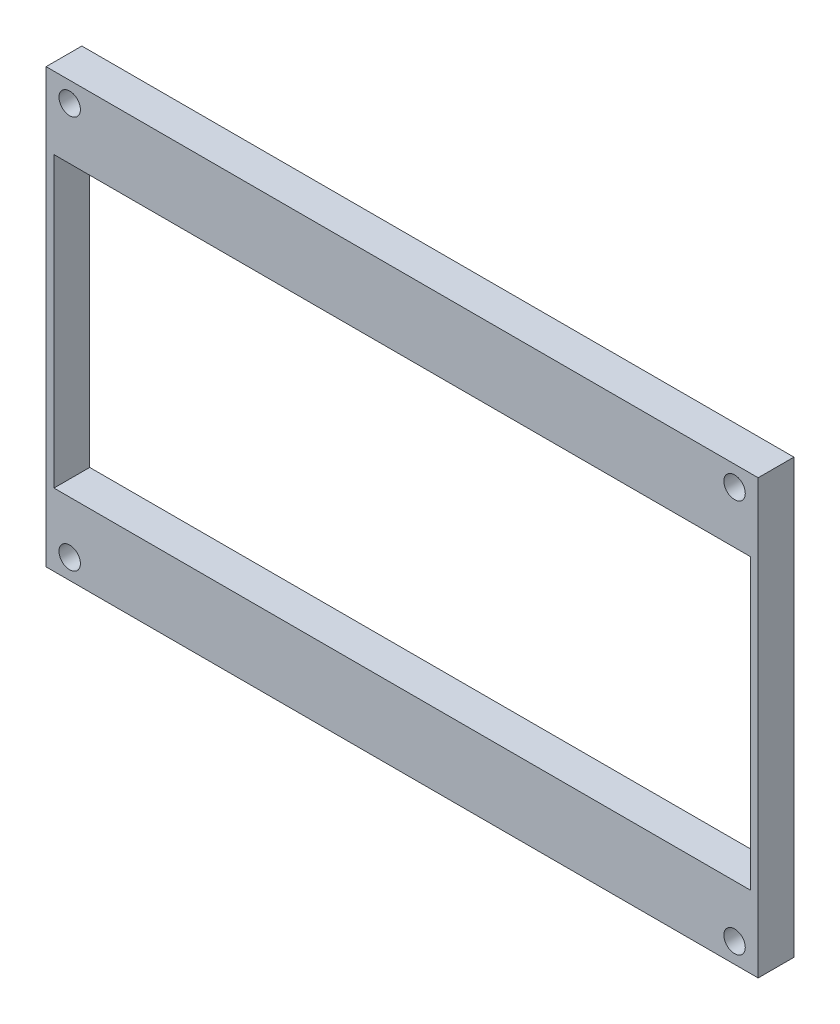
ISO-10303-21;
HEADER;
FILE_DESCRIPTION(('STEP AP214'),'2;1');
FILE_NAME('part.step','',(''),(''),'','','');
FILE_SCHEMA(('AUTOMOTIVE_DESIGN { 1 0 10303 214 1 1 1 1 }'));
ENDSEC;
DATA;
#1=APPLICATION_CONTEXT('core data for automotive mechanical design processes');
#2=APPLICATION_PROTOCOL_DEFINITION('international standard','automotive_design',2000,#1);
#3=PRODUCT_CONTEXT('',#1,'mechanical');
#4=PRODUCT('Part','Part','',(#3));
#5=PRODUCT_RELATED_PRODUCT_CATEGORY('part','',(#4));
#6=PRODUCT_DEFINITION_FORMATION('','',#4);
#7=PRODUCT_DEFINITION_CONTEXT('part definition',#1,'design');
#8=PRODUCT_DEFINITION('design','',#6,#7);
#9=PRODUCT_DEFINITION_SHAPE('','',#8);
#10=(LENGTH_UNIT() NAMED_UNIT(*) SI_UNIT(.MILLI.,.METRE.));
#11=(NAMED_UNIT(*) PLANE_ANGLE_UNIT() SI_UNIT($,.RADIAN.));
#12=(NAMED_UNIT(*) SI_UNIT($,.STERADIAN.) SOLID_ANGLE_UNIT());
#13=UNCERTAINTY_MEASURE_WITH_UNIT(LENGTH_MEASURE(1.E-05),#10,'distance_accuracy_value','');
#14=(GEOMETRIC_REPRESENTATION_CONTEXT(3) GLOBAL_UNCERTAINTY_ASSIGNED_CONTEXT((#13)) GLOBAL_UNIT_ASSIGNED_CONTEXT((#10,
#11,#12)) REPRESENTATION_CONTEXT('',''));
#15=CARTESIAN_POINT('',(0.,0.,0.));
#16=DIRECTION('',(0.,0.,1.));
#17=DIRECTION('',(1.,0.,0.));
#18=AXIS2_PLACEMENT_3D('',#15,#16,#17);
#19=CARTESIAN_POINT('',(0.,0.,5.));
#20=DIRECTION('',(0.,0.,1.));
#21=DIRECTION('',(1.,0.,0.));
#22=AXIS2_PLACEMENT_3D('',#19,#20,#21);
#23=PLANE('',#22);
#24=CARTESIAN_POINT('',(69.5,52.,5.));
#25=DIRECTION('',(0.,0.,1.));
#26=DIRECTION('',(1.,0.,0.));
#27=AXIS2_PLACEMENT_3D('',#24,#25,#26);
#28=CIRCLE('',#27,1.5);
#29=CARTESIAN_POINT('',(71.,52.,5.));
#30=VERTEX_POINT('',#29);
#31=EDGE_CURVE('E247',#30,#30,#28,.T.);
#32=ORIENTED_EDGE('',*,*,#31,.F.);
#33=EDGE_LOOP('',(#32));
#34=FACE_BOUND('',#33,.T.);
#35=CARTESIAN_POINT('',(-23.5,-3.00000000000001,5.));
#36=DIRECTION('',(0.,0.,1.));
#37=DIRECTION('',(1.,0.,0.));
#38=AXIS2_PLACEMENT_3D('',#35,#36,#37);
#39=CIRCLE('',#38,1.5);
#40=CARTESIAN_POINT('',(-22.,-3.00000000000001,5.));
#41=VERTEX_POINT('',#40);
#42=EDGE_CURVE('E129',#41,#41,#39,.T.);
#43=ORIENTED_EDGE('',*,*,#42,.F.);
#44=EDGE_LOOP('',(#43));
#45=FACE_BOUND('',#44,.T.);
#46=DIRECTION('',(0.,-1.,0.));
#47=VECTOR('',#46,1.);
#48=CARTESIAN_POINT('',(-26.8,54.8,5.));
#49=LINE('',#48,#47);
#50=CARTESIAN_POINT('',(-26.8,54.8,5.));
#51=VERTEX_POINT('',#50);
#52=CARTESIAN_POINT('',(-26.8,-5.80000000000001,5.));
#53=VERTEX_POINT('',#52);
#54=EDGE_CURVE('E139',#51,#53,#49,.T.);
#55=ORIENTED_EDGE('',*,*,#54,.T.);
#56=DIRECTION('',(1.,0.,0.));
#57=VECTOR('',#56,1.);
#58=CARTESIAN_POINT('',(-26.8,-5.80000000000001,5.));
#59=LINE('',#58,#57);
#60=CARTESIAN_POINT('',(72.8,-5.80000000000001,5.));
#61=VERTEX_POINT('',#60);
#62=EDGE_CURVE('E142',#53,#61,#59,.T.);
#63=ORIENTED_EDGE('',*,*,#62,.T.);
#64=DIRECTION('',(0.,1.,0.));
#65=VECTOR('',#64,1.);
#66=CARTESIAN_POINT('',(72.8,-5.80000000000001,5.));
#67=LINE('',#66,#65);
#68=CARTESIAN_POINT('',(72.8,54.8,5.));
#69=VERTEX_POINT('',#68);
#70=EDGE_CURVE('E145',#61,#69,#67,.T.);
#71=ORIENTED_EDGE('',*,*,#70,.T.);
#72=DIRECTION('',(-1.,0.,0.));
#73=VECTOR('',#72,1.);
#74=CARTESIAN_POINT('',(72.8,54.8,5.));
#75=LINE('',#74,#73);
#76=EDGE_CURVE('E147',#69,#51,#75,.T.);
#77=ORIENTED_EDGE('',*,*,#76,.T.);
#78=EDGE_LOOP('',(#55,#63,#71,#77));
#79=FACE_BOUND('',#78,.T.);
#80=DIRECTION('',(1.,0.,0.));
#81=VECTOR('',#80,1.);
#82=CARTESIAN_POINT('',(-25.7,4.29999999999999,5.));
#83=LINE('',#82,#81);
#84=CARTESIAN_POINT('',(-25.7,4.29999999999999,5.));
#85=VERTEX_POINT('',#84);
#86=CARTESIAN_POINT('',(71.7,4.3,5.));
#87=VERTEX_POINT('',#86);
#88=EDGE_CURVE('E108',#85,#87,#83,.T.);
#89=ORIENTED_EDGE('',*,*,#88,.F.);
#90=DIRECTION('',(0.,-1.,0.));
#91=VECTOR('',#90,1.);
#92=CARTESIAN_POINT('',(-25.7,44.7,5.));
#93=LINE('',#92,#91);
#94=CARTESIAN_POINT('',(-25.7,44.7,5.));
#95=VERTEX_POINT('',#94);
#96=EDGE_CURVE('E100',#95,#85,#93,.T.);
#97=ORIENTED_EDGE('',*,*,#96,.F.);
#98=DIRECTION('',(-1.,0.,0.));
#99=VECTOR('',#98,1.);
#100=CARTESIAN_POINT('',(71.7,44.7,5.));
#101=LINE('',#100,#99);
#102=CARTESIAN_POINT('',(71.7,44.7,5.));
#103=VERTEX_POINT('',#102);
#104=EDGE_CURVE('E123',#103,#95,#101,.T.);
#105=ORIENTED_EDGE('',*,*,#104,.F.);
#106=DIRECTION('',(0.,1.,0.));
#107=VECTOR('',#106,1.);
#108=CARTESIAN_POINT('',(71.7,4.3,5.));
#109=LINE('',#108,#107);
#110=EDGE_CURVE('E121',#87,#103,#109,.T.);
#111=ORIENTED_EDGE('',*,*,#110,.F.);
#112=EDGE_LOOP('',(#89,#97,#105,#111));
#113=FACE_BOUND('',#112,.T.);
#114=CARTESIAN_POINT('',(69.5,-3.00000000000001,5.));
#115=DIRECTION('',(0.,0.,1.));
#116=DIRECTION('',(1.,0.,0.));
#117=AXIS2_PLACEMENT_3D('',#114,#115,#116);
#118=CIRCLE('',#117,1.5);
#119=CARTESIAN_POINT('',(71.,-3.00000000000001,5.));
#120=VERTEX_POINT('',#119);
#121=EDGE_CURVE('E253',#120,#120,#118,.T.);
#122=ORIENTED_EDGE('',*,*,#121,.F.);
#123=EDGE_LOOP('',(#122));
#124=FACE_BOUND('',#123,.T.);
#125=CARTESIAN_POINT('',(-23.5,52.,5.));
#126=DIRECTION('',(0.,0.,1.));
#127=DIRECTION('',(1.,0.,0.));
#128=AXIS2_PLACEMENT_3D('',#125,#126,#127);
#129=CIRCLE('',#128,1.5);
#130=CARTESIAN_POINT('',(-22.,52.,5.));
#131=VERTEX_POINT('',#130);
#132=EDGE_CURVE('E238',#131,#131,#129,.T.);
#133=ORIENTED_EDGE('',*,*,#132,.F.);
#134=EDGE_LOOP('',(#133));
#135=FACE_BOUND('',#134,.T.);
#136=ADVANCED_FACE('F35',(#34,#45,#79,#113,#124,#135),#23,.T.);
#137=CARTESIAN_POINT('',(0.,0.,0.));
#138=DIRECTION('',(0.,0.,1.));
#139=DIRECTION('',(1.,0.,0.));
#140=AXIS2_PLACEMENT_3D('',#137,#138,#139);
#141=PLANE('',#140);
#142=DIRECTION('',(0.,-1.,0.));
#143=VECTOR('',#142,1.);
#144=CARTESIAN_POINT('',(-26.8,54.8,0.));
#145=LINE('',#144,#143);
#146=CARTESIAN_POINT('',(-26.8,54.8,0.));
#147=VERTEX_POINT('',#146);
#148=CARTESIAN_POINT('',(-26.8,-5.80000000000001,0.));
#149=VERTEX_POINT('',#148);
#150=EDGE_CURVE('E116',#147,#149,#145,.T.);
#151=ORIENTED_EDGE('',*,*,#150,.F.);
#152=DIRECTION('',(-1.,0.,0.));
#153=VECTOR('',#152,1.);
#154=CARTESIAN_POINT('',(72.8,54.8,0.));
#155=LINE('',#154,#153);
#156=CARTESIAN_POINT('',(72.8,54.8,0.));
#157=VERTEX_POINT('',#156);
#158=EDGE_CURVE('E143',#157,#147,#155,.T.);
#159=ORIENTED_EDGE('',*,*,#158,.F.);
#160=DIRECTION('',(0.,1.,0.));
#161=VECTOR('',#160,1.);
#162=CARTESIAN_POINT('',(72.8,-5.80000000000001,0.));
#163=LINE('',#162,#161);
#164=CARTESIAN_POINT('',(72.8,-5.80000000000001,0.));
#165=VERTEX_POINT('',#164);
#166=EDGE_CURVE('E154',#165,#157,#163,.T.);
#167=ORIENTED_EDGE('',*,*,#166,.F.);
#168=DIRECTION('',(1.,0.,0.));
#169=VECTOR('',#168,1.);
#170=CARTESIAN_POINT('',(-26.8,-5.80000000000001,0.));
#171=LINE('',#170,#169);
#172=EDGE_CURVE('E152',#149,#165,#171,.T.);
#173=ORIENTED_EDGE('',*,*,#172,.F.);
#174=EDGE_LOOP('',(#151,#159,#167,#173));
#175=FACE_BOUND('',#174,.T.);
#176=DIRECTION('',(0.,-1.,0.));
#177=VECTOR('',#176,1.);
#178=CARTESIAN_POINT('',(-25.7,44.7,0.));
#179=LINE('',#178,#177);
#180=CARTESIAN_POINT('',(-25.7,44.7,0.));
#181=VERTEX_POINT('',#180);
#182=CARTESIAN_POINT('',(-25.7,4.29999999999999,0.));
#183=VERTEX_POINT('',#182);
#184=EDGE_CURVE('E58',#181,#183,#179,.T.);
#185=ORIENTED_EDGE('',*,*,#184,.T.);
#186=DIRECTION('',(1.,0.,0.));
#187=VECTOR('',#186,1.);
#188=CARTESIAN_POINT('',(-25.7,4.29999999999999,0.));
#189=LINE('',#188,#187);
#190=CARTESIAN_POINT('',(71.7,4.3,0.));
#191=VERTEX_POINT('',#190);
#192=EDGE_CURVE('E115',#183,#191,#189,.T.);
#193=ORIENTED_EDGE('',*,*,#192,.T.);
#194=DIRECTION('',(0.,1.,0.));
#195=VECTOR('',#194,1.);
#196=CARTESIAN_POINT('',(71.7,4.3,0.));
#197=LINE('',#196,#195);
#198=CARTESIAN_POINT('',(71.7,44.7,0.));
#199=VERTEX_POINT('',#198);
#200=EDGE_CURVE('E131',#191,#199,#197,.T.);
#201=ORIENTED_EDGE('',*,*,#200,.T.);
#202=DIRECTION('',(-1.,0.,0.));
#203=VECTOR('',#202,1.);
#204=CARTESIAN_POINT('',(71.7,44.7,0.));
#205=LINE('',#204,#203);
#206=EDGE_CURVE('E109',#199,#181,#205,.T.);
#207=ORIENTED_EDGE('',*,*,#206,.T.);
#208=EDGE_LOOP('',(#185,#193,#201,#207));
#209=FACE_BOUND('',#208,.T.);
#210=CARTESIAN_POINT('',(-23.5,-3.00000000000001,0.));
#211=DIRECTION('',(0.,0.,1.));
#212=DIRECTION('',(1.,0.,0.));
#213=AXIS2_PLACEMENT_3D('',#210,#211,#212);
#214=CIRCLE('',#213,1.5);
#215=CARTESIAN_POINT('',(-22.,-3.00000000000001,0.));
#216=VERTEX_POINT('',#215);
#217=EDGE_CURVE('E256',#216,#216,#214,.T.);
#218=ORIENTED_EDGE('',*,*,#217,.T.);
#219=EDGE_LOOP('',(#218));
#220=FACE_BOUND('',#219,.T.);
#221=CARTESIAN_POINT('',(69.5,-3.00000000000001,0.));
#222=DIRECTION('',(0.,0.,1.));
#223=DIRECTION('',(1.,0.,0.));
#224=AXIS2_PLACEMENT_3D('',#221,#222,#223);
#225=CIRCLE('',#224,1.5);
#226=CARTESIAN_POINT('',(71.,-3.00000000000001,0.));
#227=VERTEX_POINT('',#226);
#228=EDGE_CURVE('E250',#227,#227,#225,.T.);
#229=ORIENTED_EDGE('',*,*,#228,.T.);
#230=EDGE_LOOP('',(#229));
#231=FACE_BOUND('',#230,.T.);
#232=CARTESIAN_POINT('',(69.5,52.,0.));
#233=DIRECTION('',(0.,0.,1.));
#234=DIRECTION('',(1.,0.,0.));
#235=AXIS2_PLACEMENT_3D('',#232,#233,#234);
#236=CIRCLE('',#235,1.5);
#237=CARTESIAN_POINT('',(71.,52.,0.));
#238=VERTEX_POINT('',#237);
#239=EDGE_CURVE('E244',#238,#238,#236,.T.);
#240=ORIENTED_EDGE('',*,*,#239,.T.);
#241=EDGE_LOOP('',(#240));
#242=FACE_BOUND('',#241,.T.);
#243=CARTESIAN_POINT('',(-23.5,52.,0.));
#244=DIRECTION('',(0.,0.,1.));
#245=DIRECTION('',(1.,0.,0.));
#246=AXIS2_PLACEMENT_3D('',#243,#244,#245);
#247=CIRCLE('',#246,1.5);
#248=CARTESIAN_POINT('',(-22.,52.,0.));
#249=VERTEX_POINT('',#248);
#250=EDGE_CURVE('E241',#249,#249,#247,.T.);
#251=ORIENTED_EDGE('',*,*,#250,.T.);
#252=EDGE_LOOP('',(#251));
#253=FACE_BOUND('',#252,.T.);
#254=ADVANCED_FACE('F172',(#175,#209,#220,#231,#242,#253),#141,.F.);
#255=CARTESIAN_POINT('',(-26.8,54.8,5.));
#256=DIRECTION('',(1.,0.,0.));
#257=DIRECTION('',(0.,1.,0.));
#258=AXIS2_PLACEMENT_3D('',#255,#256,#257);
#259=PLANE('',#258);
#260=ORIENTED_EDGE('',*,*,#150,.T.);
#261=DIRECTION('',(0.,0.,-1.));
#262=VECTOR('',#261,1.);
#263=CARTESIAN_POINT('',(-26.8,-5.80000000000001,5.));
#264=LINE('',#263,#262);
#265=EDGE_CURVE('E11',#53,#149,#264,.T.);
#266=ORIENTED_EDGE('',*,*,#265,.F.);
#267=ORIENTED_EDGE('',*,*,#54,.F.);
#268=DIRECTION('',(0.,0.,-1.));
#269=VECTOR('',#268,1.);
#270=CARTESIAN_POINT('',(-26.8,54.8,5.));
#271=LINE('',#270,#269);
#272=EDGE_CURVE('E149',#51,#147,#271,.T.);
#273=ORIENTED_EDGE('',*,*,#272,.T.);
#274=EDGE_LOOP('',(#260,#266,#267,#273));
#275=FACE_BOUND('',#274,.T.);
#276=ADVANCED_FACE('F37',(#275),#259,.F.);
#277=CARTESIAN_POINT('',(-26.8,-5.80000000000001,5.));
#278=DIRECTION('',(0.,1.,0.));
#279=DIRECTION('',(0.,0.,1.));
#280=AXIS2_PLACEMENT_3D('',#277,#278,#279);
#281=PLANE('',#280);
#282=ORIENTED_EDGE('',*,*,#172,.T.);
#283=DIRECTION('',(0.,0.,-1.));
#284=VECTOR('',#283,1.);
#285=CARTESIAN_POINT('',(72.8,-5.80000000000001,5.));
#286=LINE('',#285,#284);
#287=EDGE_CURVE('E43',#61,#165,#286,.T.);
#288=ORIENTED_EDGE('',*,*,#287,.F.);
#289=ORIENTED_EDGE('',*,*,#62,.F.);
#290=ORIENTED_EDGE('',*,*,#265,.T.);
#291=EDGE_LOOP('',(#282,#288,#289,#290));
#292=FACE_BOUND('',#291,.T.);
#293=ADVANCED_FACE('F182',(#292),#281,.F.);
#294=CARTESIAN_POINT('',(72.8,-5.80000000000001,5.));
#295=DIRECTION('',(-1.,0.,0.));
#296=DIRECTION('',(0.,-1.,0.));
#297=AXIS2_PLACEMENT_3D('',#294,#295,#296);
#298=PLANE('',#297);
#299=ORIENTED_EDGE('',*,*,#166,.T.);
#300=DIRECTION('',(0.,0.,-1.));
#301=VECTOR('',#300,1.);
#302=CARTESIAN_POINT('',(72.8,54.8,5.));
#303=LINE('',#302,#301);
#304=EDGE_CURVE('E159',#69,#157,#303,.T.);
#305=ORIENTED_EDGE('',*,*,#304,.F.);
#306=ORIENTED_EDGE('',*,*,#70,.F.);
#307=ORIENTED_EDGE('',*,*,#287,.T.);
#308=EDGE_LOOP('',(#299,#305,#306,#307));
#309=FACE_BOUND('',#308,.T.);
#310=ADVANCED_FACE('F166',(#309),#298,.F.);
#311=CARTESIAN_POINT('',(72.8,54.8,5.));
#312=DIRECTION('',(0.,-1.,0.));
#313=DIRECTION('',(0.,0.,-1.));
#314=AXIS2_PLACEMENT_3D('',#311,#312,#313);
#315=PLANE('',#314);
#316=ORIENTED_EDGE('',*,*,#158,.T.);
#317=ORIENTED_EDGE('',*,*,#272,.F.);
#318=ORIENTED_EDGE('',*,*,#76,.F.);
#319=ORIENTED_EDGE('',*,*,#304,.T.);
#320=EDGE_LOOP('',(#316,#317,#318,#319));
#321=FACE_BOUND('',#320,.T.);
#322=ADVANCED_FACE('F176',(#321),#315,.F.);
#323=CARTESIAN_POINT('',(-25.7,44.7,5.));
#324=DIRECTION('',(1.,0.,0.));
#325=DIRECTION('',(0.,0.,-1.));
#326=AXIS2_PLACEMENT_3D('',#323,#324,#325);
#327=PLANE('',#326);
#328=ORIENTED_EDGE('',*,*,#184,.F.);
#329=DIRECTION('',(0.,0.,-1.));
#330=VECTOR('',#329,1.);
#331=CARTESIAN_POINT('',(-25.7,44.7,5.));
#332=LINE('',#331,#330);
#333=EDGE_CURVE('E104',#95,#181,#332,.T.);
#334=ORIENTED_EDGE('',*,*,#333,.F.);
#335=ORIENTED_EDGE('',*,*,#96,.T.);
#336=DIRECTION('',(0.,0.,-1.));
#337=VECTOR('',#336,1.);
#338=CARTESIAN_POINT('',(-25.7,4.29999999999999,5.));
#339=LINE('',#338,#337);
#340=EDGE_CURVE('E103',#85,#183,#339,.T.);
#341=ORIENTED_EDGE('',*,*,#340,.T.);
#342=EDGE_LOOP('',(#328,#334,#335,#341));
#343=FACE_BOUND('',#342,.T.);
#344=ADVANCED_FACE('F102',(#343),#327,.T.);
#345=CARTESIAN_POINT('',(-25.7,4.29999999999999,5.));
#346=DIRECTION('',(0.,1.,0.));
#347=DIRECTION('',(-1.,0.,0.));
#348=AXIS2_PLACEMENT_3D('',#345,#346,#347);
#349=PLANE('',#348);
#350=ORIENTED_EDGE('',*,*,#192,.F.);
#351=ORIENTED_EDGE('',*,*,#340,.F.);
#352=ORIENTED_EDGE('',*,*,#88,.T.);
#353=DIRECTION('',(0.,0.,-1.));
#354=VECTOR('',#353,1.);
#355=CARTESIAN_POINT('',(71.7,4.3,5.));
#356=LINE('',#355,#354);
#357=EDGE_CURVE('E117',#87,#191,#356,.T.);
#358=ORIENTED_EDGE('',*,*,#357,.T.);
#359=EDGE_LOOP('',(#350,#351,#352,#358));
#360=FACE_BOUND('',#359,.T.);
#361=ADVANCED_FACE('F112',(#360),#349,.T.);
#362=CARTESIAN_POINT('',(71.7,4.3,5.));
#363=DIRECTION('',(-1.,0.,0.));
#364=DIRECTION('',(0.,0.,1.));
#365=AXIS2_PLACEMENT_3D('',#362,#363,#364);
#366=PLANE('',#365);
#367=ORIENTED_EDGE('',*,*,#200,.F.);
#368=ORIENTED_EDGE('',*,*,#357,.F.);
#369=ORIENTED_EDGE('',*,*,#110,.T.);
#370=DIRECTION('',(0.,0.,-1.));
#371=VECTOR('',#370,1.);
#372=CARTESIAN_POINT('',(71.7,44.7,5.));
#373=LINE('',#372,#371);
#374=EDGE_CURVE('E50',#103,#199,#373,.T.);
#375=ORIENTED_EDGE('',*,*,#374,.T.);
#376=EDGE_LOOP('',(#367,#368,#369,#375));
#377=FACE_BOUND('',#376,.T.);
#378=ADVANCED_FACE('F208',(#377),#366,.T.);
#379=CARTESIAN_POINT('',(71.7,44.7,5.));
#380=DIRECTION('',(0.,-1.,0.));
#381=DIRECTION('',(1.,0.,0.));
#382=AXIS2_PLACEMENT_3D('',#379,#380,#381);
#383=PLANE('',#382);
#384=ORIENTED_EDGE('',*,*,#206,.F.);
#385=ORIENTED_EDGE('',*,*,#374,.F.);
#386=ORIENTED_EDGE('',*,*,#104,.T.);
#387=ORIENTED_EDGE('',*,*,#333,.T.);
#388=EDGE_LOOP('',(#384,#385,#386,#387));
#389=FACE_BOUND('',#388,.T.);
#390=ADVANCED_FACE('F212',(#389),#383,.T.);
#391=CARTESIAN_POINT('',(-23.5,-3.00000000000001,5.));
#392=DIRECTION('',(0.,0.,-1.));
#393=DIRECTION('',(-1.,0.,0.));
#394=AXIS2_PLACEMENT_3D('',#391,#392,#393);
#395=CYLINDRICAL_SURFACE('',#394,1.5);
#396=ORIENTED_EDGE('',*,*,#42,.T.);
#397=EDGE_LOOP('',(#396));
#398=FACE_BOUND('',#397,.T.);
#399=ORIENTED_EDGE('',*,*,#217,.F.);
#400=EDGE_LOOP('',(#399));
#401=FACE_BOUND('',#400,.T.);
#402=ADVANCED_FACE('F218',(#398,#401),#395,.F.);
#403=CARTESIAN_POINT('',(69.5,-3.00000000000001,5.));
#404=DIRECTION('',(0.,0.,-1.));
#405=DIRECTION('',(-1.,0.,0.));
#406=AXIS2_PLACEMENT_3D('',#403,#404,#405);
#407=CYLINDRICAL_SURFACE('',#406,1.5);
#408=ORIENTED_EDGE('',*,*,#121,.T.);
#409=EDGE_LOOP('',(#408));
#410=FACE_BOUND('',#409,.T.);
#411=ORIENTED_EDGE('',*,*,#228,.F.);
#412=EDGE_LOOP('',(#411));
#413=FACE_BOUND('',#412,.T.);
#414=ADVANCED_FACE('F221',(#410,#413),#407,.F.);
#415=CARTESIAN_POINT('',(69.5,52.,5.));
#416=DIRECTION('',(0.,0.,-1.));
#417=DIRECTION('',(-1.,0.,0.));
#418=AXIS2_PLACEMENT_3D('',#415,#416,#417);
#419=CYLINDRICAL_SURFACE('',#418,1.5);
#420=ORIENTED_EDGE('',*,*,#31,.T.);
#421=EDGE_LOOP('',(#420));
#422=FACE_BOUND('',#421,.T.);
#423=ORIENTED_EDGE('',*,*,#239,.F.);
#424=EDGE_LOOP('',(#423));
#425=FACE_BOUND('',#424,.T.);
#426=ADVANCED_FACE('F225',(#422,#425),#419,.F.);
#427=CARTESIAN_POINT('',(-23.5,52.,5.));
#428=DIRECTION('',(0.,0.,-1.));
#429=DIRECTION('',(-1.,0.,0.));
#430=AXIS2_PLACEMENT_3D('',#427,#428,#429);
#431=CYLINDRICAL_SURFACE('',#430,1.5);
#432=ORIENTED_EDGE('',*,*,#132,.T.);
#433=EDGE_LOOP('',(#432));
#434=FACE_BOUND('',#433,.T.);
#435=ORIENTED_EDGE('',*,*,#250,.F.);
#436=EDGE_LOOP('',(#435));
#437=FACE_BOUND('',#436,.T.);
#438=ADVANCED_FACE('F229',(#434,#437),#431,.F.);
#439=CLOSED_SHELL('',(#136,#254,#276,#293,#310,#322,#344,#361,#378,#390,#402,#414,#426,#438));
#440=MANIFOLD_SOLID_BREP('B2',#439);
#441=ADVANCED_BREP_SHAPE_REPRESENTATION('',(#18,#440),#14);
#442=SHAPE_DEFINITION_REPRESENTATION(#9,#441);
ENDSEC;
END-ISO-10303-21;
